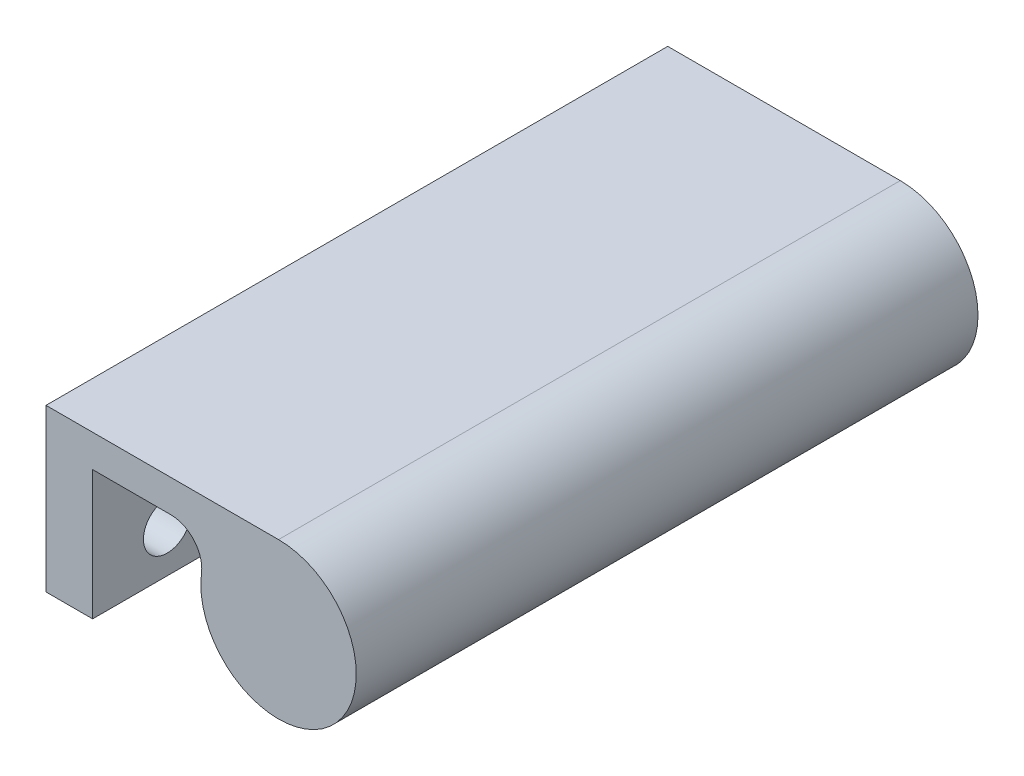
ISO-10303-21;
HEADER;
FILE_DESCRIPTION(('STEP AP214'),'2;1');
FILE_NAME('part.step','',(''),(''),'','','');
FILE_SCHEMA(('AUTOMOTIVE_DESIGN { 1 0 10303 214 1 1 1 1 }'));
ENDSEC;
DATA;
#1=APPLICATION_CONTEXT('core data for automotive mechanical design processes');
#2=APPLICATION_PROTOCOL_DEFINITION('international standard','automotive_design',2000,#1);
#3=PRODUCT_CONTEXT('',#1,'mechanical');
#4=PRODUCT('Part','Part','',(#3));
#5=PRODUCT_RELATED_PRODUCT_CATEGORY('part','',(#4));
#6=PRODUCT_DEFINITION_FORMATION('','',#4);
#7=PRODUCT_DEFINITION_CONTEXT('part definition',#1,'design');
#8=PRODUCT_DEFINITION('design','',#6,#7);
#9=PRODUCT_DEFINITION_SHAPE('','',#8);
#10=(LENGTH_UNIT() NAMED_UNIT(*) SI_UNIT(.MILLI.,.METRE.));
#11=(NAMED_UNIT(*) PLANE_ANGLE_UNIT() SI_UNIT($,.RADIAN.));
#12=(NAMED_UNIT(*) SI_UNIT($,.STERADIAN.) SOLID_ANGLE_UNIT());
#13=UNCERTAINTY_MEASURE_WITH_UNIT(LENGTH_MEASURE(1.E-05),#10,'distance_accuracy_value','');
#14=(GEOMETRIC_REPRESENTATION_CONTEXT(3) GLOBAL_UNCERTAINTY_ASSIGNED_CONTEXT((#13)) GLOBAL_UNIT_ASSIGNED_CONTEXT((#10,
#11,#12)) REPRESENTATION_CONTEXT('',''));
#15=CARTESIAN_POINT('',(0.,0.,0.));
#16=DIRECTION('',(0.,0.,1.));
#17=DIRECTION('',(1.,0.,0.));
#18=AXIS2_PLACEMENT_3D('',#15,#16,#17);
#19=CARTESIAN_POINT('',(4.7625,0.,0.));
#20=DIRECTION('',(0.,0.,-1.));
#21=DIRECTION('',(-1.,0.,0.));
#22=AXIS2_PLACEMENT_3D('',#19,#20,#21);
#23=PLANE('',#22);
#24=DIRECTION('',(0.,-1.,0.));
#25=VECTOR('',#24,1.);
#26=CARTESIAN_POINT('',(0.,0.,0.));
#27=LINE('',#26,#25);
#28=CARTESIAN_POINT('',(0.,16.51,0.));
#29=VERTEX_POINT('',#28);
#30=CARTESIAN_POINT('',(0.,0.,0.));
#31=VERTEX_POINT('',#30);
#32=EDGE_CURVE('E105',#29,#31,#27,.T.);
#33=ORIENTED_EDGE('',*,*,#32,.T.);
#34=DIRECTION('',(-1.,0.,0.));
#35=VECTOR('',#34,1.);
#36=CARTESIAN_POINT('',(4.7625,0.,0.));
#37=LINE('',#36,#35);
#38=CARTESIAN_POINT('',(4.7625,0.,0.));
#39=VERTEX_POINT('',#38);
#40=EDGE_CURVE('E11',#39,#31,#37,.T.);
#41=ORIENTED_EDGE('',*,*,#40,.F.);
#42=DIRECTION('',(0.,-1.,0.));
#43=VECTOR('',#42,1.);
#44=CARTESIAN_POINT('',(4.7625,0.,0.));
#45=LINE('',#44,#43);
#46=CARTESIAN_POINT('',(4.7625,13.208,0.));
#47=VERTEX_POINT('',#46);
#48=EDGE_CURVE('E130',#47,#39,#45,.T.);
#49=ORIENTED_EDGE('',*,*,#48,.F.);
#50=DIRECTION('',(-1.,0.,0.));
#51=VECTOR('',#50,1.);
#52=CARTESIAN_POINT('',(5.7785,13.208,0.));
#53=LINE('',#52,#51);
#54=CARTESIAN_POINT('',(12.7328937913617,13.208,0.));
#55=VERTEX_POINT('',#54);
#56=EDGE_CURVE('E133',#55,#47,#53,.T.);
#57=ORIENTED_EDGE('',*,*,#56,.F.);
#58=CARTESIAN_POINT('',(12.7328937913617,10.033,0.));
#59=DIRECTION('',(0.,0.,-1.));
#60=DIRECTION('',(1.,0.,0.));
#61=AXIS2_PLACEMENT_3D('',#58,#59,#60);
#62=CIRCLE('',#61,3.175);
#63=CARTESIAN_POINT('',(15.8803527081155,9.61571428571428,0.));
#64=VERTEX_POINT('',#63);
#65=EDGE_CURVE('E232',#55,#64,#62,.T.);
#66=ORIENTED_EDGE('',*,*,#65,.T.);
#67=CARTESIAN_POINT('',(23.749,8.5725,0.));
#68=DIRECTION('',(0.,0.,1.));
#69=DIRECTION('',(1.,0.,0.));
#70=AXIS2_PLACEMENT_3D('',#67,#68,#69);
#71=CIRCLE('',#70,7.9375);
#72=CARTESIAN_POINT('',(23.749,16.51,0.));
#73=VERTEX_POINT('',#72);
#74=EDGE_CURVE('E108',#64,#73,#71,.T.);
#75=ORIENTED_EDGE('',*,*,#74,.T.);
#76=DIRECTION('',(-1.,0.,0.));
#77=VECTOR('',#76,1.);
#78=CARTESIAN_POINT('',(4.7625,16.51,0.));
#79=LINE('',#78,#77);
#80=EDGE_CURVE('E91',#73,#29,#79,.T.);
#81=ORIENTED_EDGE('',*,*,#80,.T.);
#82=EDGE_LOOP('',(#33,#41,#49,#57,#66,#75,#81));
#83=FACE_BOUND('',#82,.T.);
#84=ADVANCED_FACE('F45',(#83),#23,.F.);
#85=CARTESIAN_POINT('',(4.7625,0.,0.));
#86=DIRECTION('',(0.,1.,0.));
#87=DIRECTION('',(0.,0.,1.));
#88=AXIS2_PLACEMENT_3D('',#85,#86,#87);
#89=PLANE('',#88);
#90=DIRECTION('',(0.,0.,-1.));
#91=VECTOR('',#90,1.);
#92=CARTESIAN_POINT('',(0.,0.,0.));
#93=LINE('',#92,#91);
#94=CARTESIAN_POINT('',(0.,0.,-63.5));
#95=VERTEX_POINT('',#94);
#96=EDGE_CURVE('E112',#31,#95,#93,.T.);
#97=ORIENTED_EDGE('',*,*,#96,.T.);
#98=DIRECTION('',(-1.,0.,0.));
#99=VECTOR('',#98,1.);
#100=CARTESIAN_POINT('',(4.7625,0.,-63.5));
#101=LINE('',#100,#99);
#102=CARTESIAN_POINT('',(4.7625,0.,-63.5));
#103=VERTEX_POINT('',#102);
#104=EDGE_CURVE('E53',#103,#95,#101,.T.);
#105=ORIENTED_EDGE('',*,*,#104,.F.);
#106=DIRECTION('',(0.,0.,-1.));
#107=VECTOR('',#106,1.);
#108=CARTESIAN_POINT('',(4.7625,0.,0.));
#109=LINE('',#108,#107);
#110=EDGE_CURVE('E66',#39,#103,#109,.T.);
#111=ORIENTED_EDGE('',*,*,#110,.F.);
#112=ORIENTED_EDGE('',*,*,#40,.T.);
#113=EDGE_LOOP('',(#97,#105,#111,#112));
#114=FACE_BOUND('',#113,.T.);
#115=ADVANCED_FACE('F128',(#114),#89,.F.);
#116=CARTESIAN_POINT('',(4.7625,0.,-63.5));
#117=DIRECTION('',(0.,0.,1.));
#118=DIRECTION('',(1.,0.,0.));
#119=AXIS2_PLACEMENT_3D('',#116,#117,#118);
#120=PLANE('',#119);
#121=DIRECTION('',(0.,1.,0.));
#122=VECTOR('',#121,1.);
#123=CARTESIAN_POINT('',(0.,0.,-63.5));
#124=LINE('',#123,#122);
#125=CARTESIAN_POINT('',(0.,16.51,-63.5));
#126=VERTEX_POINT('',#125);
#127=EDGE_CURVE('E99',#95,#126,#124,.T.);
#128=ORIENTED_EDGE('',*,*,#127,.T.);
#129=DIRECTION('',(-1.,0.,0.));
#130=VECTOR('',#129,1.);
#131=CARTESIAN_POINT('',(4.7625,16.51,-63.5));
#132=LINE('',#131,#130);
#133=CARTESIAN_POINT('',(23.749,16.51,-63.5));
#134=VERTEX_POINT('',#133);
#135=EDGE_CURVE('E94',#134,#126,#132,.T.);
#136=ORIENTED_EDGE('',*,*,#135,.F.);
#137=CARTESIAN_POINT('',(23.749,8.5725,-63.5));
#138=DIRECTION('',(0.,0.,1.));
#139=DIRECTION('',(1.,0.,0.));
#140=AXIS2_PLACEMENT_3D('',#137,#138,#139);
#141=CIRCLE('',#140,7.9375);
#142=CARTESIAN_POINT('',(15.8803527081155,9.61571428571428,-63.5));
#143=VERTEX_POINT('',#142);
#144=EDGE_CURVE('E240',#143,#134,#141,.T.);
#145=ORIENTED_EDGE('',*,*,#144,.F.);
#146=CARTESIAN_POINT('',(12.7328937913617,10.033,-63.5));
#147=DIRECTION('',(0.,0.,-1.));
#148=DIRECTION('',(1.,0.,0.));
#149=AXIS2_PLACEMENT_3D('',#146,#147,#148);
#150=CIRCLE('',#149,3.175);
#151=CARTESIAN_POINT('',(12.7328937913617,13.208,-63.5));
#152=VERTEX_POINT('',#151);
#153=EDGE_CURVE('E243',#152,#143,#150,.T.);
#154=ORIENTED_EDGE('',*,*,#153,.F.);
#155=DIRECTION('',(-1.,0.,0.));
#156=VECTOR('',#155,1.);
#157=CARTESIAN_POINT('',(5.7785,13.208,-63.5));
#158=LINE('',#157,#156);
#159=CARTESIAN_POINT('',(4.7625,13.208,-63.5));
#160=VERTEX_POINT('',#159);
#161=EDGE_CURVE('E144',#152,#160,#158,.T.);
#162=ORIENTED_EDGE('',*,*,#161,.T.);
#163=DIRECTION('',(0.,1.,0.));
#164=VECTOR('',#163,1.);
#165=CARTESIAN_POINT('',(4.7625,0.,-63.5));
#166=LINE('',#165,#164);
#167=EDGE_CURVE('E109',#103,#160,#166,.T.);
#168=ORIENTED_EDGE('',*,*,#167,.F.);
#169=ORIENTED_EDGE('',*,*,#104,.T.);
#170=EDGE_LOOP('',(#128,#136,#145,#154,#162,#168,#169));
#171=FACE_BOUND('',#170,.T.);
#172=ADVANCED_FACE('F125',(#171),#120,.F.);
#173=CARTESIAN_POINT('',(4.7625,4.445,-7.62));
#174=DIRECTION('',(-1.,0.,0.));
#175=DIRECTION('',(0.,0.,1.));
#176=AXIS2_PLACEMENT_3D('',#173,#174,#175);
#177=CYLINDRICAL_SURFACE('',#176,2.4328565762324);
#178=CARTESIAN_POINT('',(4.7625,4.445,-7.62));
#179=DIRECTION('',(1.,0.,0.));
#180=DIRECTION('',(0.,0.,-1.));
#181=AXIS2_PLACEMENT_3D('',#178,#179,#180);
#182=CIRCLE('',#181,2.4328565762324);
#183=CARTESIAN_POINT('',(4.7625,4.445,-10.0528565762324));
#184=VERTEX_POINT('',#183);
#185=EDGE_CURVE('E135',#184,#184,#182,.T.);
#186=ORIENTED_EDGE('',*,*,#185,.T.);
#187=EDGE_LOOP('',(#186));
#188=FACE_BOUND('',#187,.T.);
#189=CARTESIAN_POINT('',(0.,4.445,-7.62));
#190=DIRECTION('',(1.,0.,0.));
#191=DIRECTION('',(0.,0.,-1.));
#192=AXIS2_PLACEMENT_3D('',#189,#190,#191);
#193=CIRCLE('',#192,2.4328565762324);
#194=CARTESIAN_POINT('',(0.,4.445,-10.0528565762324));
#195=VERTEX_POINT('',#194);
#196=EDGE_CURVE('E113',#195,#195,#193,.T.);
#197=ORIENTED_EDGE('',*,*,#196,.F.);
#198=EDGE_LOOP('',(#197));
#199=FACE_BOUND('',#198,.T.);
#200=ADVANCED_FACE('F191',(#188,#199),#177,.F.);
#201=CARTESIAN_POINT('',(4.7625,4.445,-15.61846));
#202=DIRECTION('',(-1.,0.,0.));
#203=DIRECTION('',(0.,0.,1.));
#204=AXIS2_PLACEMENT_3D('',#201,#202,#203);
#205=CYLINDRICAL_SURFACE('',#204,2.4328565762324);
#206=CARTESIAN_POINT('',(4.7625,4.445,-15.61846));
#207=DIRECTION('',(1.,0.,0.));
#208=DIRECTION('',(0.,0.,-1.));
#209=AXIS2_PLACEMENT_3D('',#206,#207,#208);
#210=CIRCLE('',#209,2.4328565762324);
#211=CARTESIAN_POINT('',(4.7625,4.445,-18.0513165762324));
#212=VERTEX_POINT('',#211);
#213=EDGE_CURVE('E166',#212,#212,#210,.T.);
#214=ORIENTED_EDGE('',*,*,#213,.T.);
#215=EDGE_LOOP('',(#214));
#216=FACE_BOUND('',#215,.T.);
#217=CARTESIAN_POINT('',(0.,4.445,-15.61846));
#218=DIRECTION('',(1.,0.,0.));
#219=DIRECTION('',(0.,0.,-1.));
#220=AXIS2_PLACEMENT_3D('',#217,#218,#219);
#221=CIRCLE('',#220,2.4328565762324);
#222=CARTESIAN_POINT('',(0.,4.445,-18.0513165762324));
#223=VERTEX_POINT('',#222);
#224=EDGE_CURVE('E117',#223,#223,#221,.T.);
#225=ORIENTED_EDGE('',*,*,#224,.F.);
#226=EDGE_LOOP('',(#225));
#227=FACE_BOUND('',#226,.T.);
#228=ADVANCED_FACE('F188',(#216,#227),#205,.F.);
#229=CARTESIAN_POINT('',(4.7625,4.44500000000001,-23.61692));
#230=DIRECTION('',(-1.,0.,0.));
#231=DIRECTION('',(0.,0.,1.));
#232=AXIS2_PLACEMENT_3D('',#229,#230,#231);
#233=CYLINDRICAL_SURFACE('',#232,2.4328565762324);
#234=CARTESIAN_POINT('',(4.7625,4.44500000000001,-23.61692));
#235=DIRECTION('',(1.,0.,0.));
#236=DIRECTION('',(0.,0.,-1.));
#237=AXIS2_PLACEMENT_3D('',#234,#235,#236);
#238=CIRCLE('',#237,2.4328565762324);
#239=CARTESIAN_POINT('',(4.7625,4.44500000000001,-26.0497765762324));
#240=VERTEX_POINT('',#239);
#241=EDGE_CURVE('E163',#240,#240,#238,.T.);
#242=ORIENTED_EDGE('',*,*,#241,.T.);
#243=EDGE_LOOP('',(#242));
#244=FACE_BOUND('',#243,.T.);
#245=CARTESIAN_POINT('',(0.,4.44500000000001,-23.61692));
#246=DIRECTION('',(1.,0.,0.));
#247=DIRECTION('',(0.,0.,-1.));
#248=AXIS2_PLACEMENT_3D('',#245,#246,#247);
#249=CIRCLE('',#248,2.4328565762324);
#250=CARTESIAN_POINT('',(0.,4.44500000000001,-26.0497765762324));
#251=VERTEX_POINT('',#250);
#252=EDGE_CURVE('E181',#251,#251,#249,.T.);
#253=ORIENTED_EDGE('',*,*,#252,.F.);
#254=EDGE_LOOP('',(#253));
#255=FACE_BOUND('',#254,.T.);
#256=ADVANCED_FACE('F190',(#244,#255),#233,.F.);
#257=CARTESIAN_POINT('',(4.7625,4.44500000000001,-31.61538));
#258=DIRECTION('',(-1.,0.,0.));
#259=DIRECTION('',(0.,0.,1.));
#260=AXIS2_PLACEMENT_3D('',#257,#258,#259);
#261=CYLINDRICAL_SURFACE('',#260,2.4328565762324);
#262=CARTESIAN_POINT('',(4.7625,4.44500000000001,-31.61538));
#263=DIRECTION('',(1.,0.,0.));
#264=DIRECTION('',(0.,0.,-1.));
#265=AXIS2_PLACEMENT_3D('',#262,#263,#264);
#266=CIRCLE('',#265,2.4328565762324);
#267=CARTESIAN_POINT('',(4.7625,4.44500000000001,-34.0482365762324));
#268=VERTEX_POINT('',#267);
#269=EDGE_CURVE('E160',#268,#268,#266,.T.);
#270=ORIENTED_EDGE('',*,*,#269,.T.);
#271=EDGE_LOOP('',(#270));
#272=FACE_BOUND('',#271,.T.);
#273=CARTESIAN_POINT('',(0.,4.44500000000001,-31.61538));
#274=DIRECTION('',(1.,0.,0.));
#275=DIRECTION('',(0.,0.,-1.));
#276=AXIS2_PLACEMENT_3D('',#273,#274,#275);
#277=CIRCLE('',#276,2.4328565762324);
#278=CARTESIAN_POINT('',(0.,4.44500000000001,-34.0482365762324));
#279=VERTEX_POINT('',#278);
#280=EDGE_CURVE('E178',#279,#279,#277,.T.);
#281=ORIENTED_EDGE('',*,*,#280,.F.);
#282=EDGE_LOOP('',(#281));
#283=FACE_BOUND('',#282,.T.);
#284=ADVANCED_FACE('F198',(#272,#283),#261,.F.);
#285=CARTESIAN_POINT('',(4.7625,4.44500000000001,-39.61384));
#286=DIRECTION('',(-1.,0.,0.));
#287=DIRECTION('',(0.,0.,1.));
#288=AXIS2_PLACEMENT_3D('',#285,#286,#287);
#289=CYLINDRICAL_SURFACE('',#288,2.4328565762324);
#290=CARTESIAN_POINT('',(4.7625,4.44500000000001,-39.61384));
#291=DIRECTION('',(1.,0.,0.));
#292=DIRECTION('',(0.,0.,-1.));
#293=AXIS2_PLACEMENT_3D('',#290,#291,#292);
#294=CIRCLE('',#293,2.4328565762324);
#295=CARTESIAN_POINT('',(4.7625,4.44500000000001,-42.0466965762324));
#296=VERTEX_POINT('',#295);
#297=EDGE_CURVE('E157',#296,#296,#294,.T.);
#298=ORIENTED_EDGE('',*,*,#297,.T.);
#299=EDGE_LOOP('',(#298));
#300=FACE_BOUND('',#299,.T.);
#301=CARTESIAN_POINT('',(0.,4.44500000000001,-39.61384));
#302=DIRECTION('',(1.,0.,0.));
#303=DIRECTION('',(0.,0.,-1.));
#304=AXIS2_PLACEMENT_3D('',#301,#302,#303);
#305=CIRCLE('',#304,2.4328565762324);
#306=CARTESIAN_POINT('',(0.,4.44500000000001,-42.0466965762324));
#307=VERTEX_POINT('',#306);
#308=EDGE_CURVE('E175',#307,#307,#305,.T.);
#309=ORIENTED_EDGE('',*,*,#308,.F.);
#310=EDGE_LOOP('',(#309));
#311=FACE_BOUND('',#310,.T.);
#312=ADVANCED_FACE('F281',(#300,#311),#289,.F.);
#313=CARTESIAN_POINT('',(4.7625,4.44500000000001,-47.6123));
#314=DIRECTION('',(-1.,0.,0.));
#315=DIRECTION('',(0.,0.,1.));
#316=AXIS2_PLACEMENT_3D('',#313,#314,#315);
#317=CYLINDRICAL_SURFACE('',#316,2.4328565762324);
#318=CARTESIAN_POINT('',(4.7625,4.44500000000001,-47.6123));
#319=DIRECTION('',(1.,0.,0.));
#320=DIRECTION('',(0.,0.,-1.));
#321=AXIS2_PLACEMENT_3D('',#318,#319,#320);
#322=CIRCLE('',#321,2.4328565762324);
#323=CARTESIAN_POINT('',(4.7625,4.44500000000001,-50.0451565762324));
#324=VERTEX_POINT('',#323);
#325=EDGE_CURVE('E154',#324,#324,#322,.T.);
#326=ORIENTED_EDGE('',*,*,#325,.T.);
#327=EDGE_LOOP('',(#326));
#328=FACE_BOUND('',#327,.T.);
#329=CARTESIAN_POINT('',(0.,4.44500000000001,-47.6123));
#330=DIRECTION('',(1.,0.,0.));
#331=DIRECTION('',(0.,0.,-1.));
#332=AXIS2_PLACEMENT_3D('',#329,#330,#331);
#333=CIRCLE('',#332,2.4328565762324);
#334=CARTESIAN_POINT('',(0.,4.44500000000001,-50.0451565762324));
#335=VERTEX_POINT('',#334);
#336=EDGE_CURVE('E147',#335,#335,#333,.T.);
#337=ORIENTED_EDGE('',*,*,#336,.F.);
#338=EDGE_LOOP('',(#337));
#339=FACE_BOUND('',#338,.T.);
#340=ADVANCED_FACE('F288',(#328,#339),#317,.F.);
#341=CARTESIAN_POINT('',(4.7625,4.44500000000001,-55.61076));
#342=DIRECTION('',(-1.,0.,0.));
#343=DIRECTION('',(0.,0.,1.));
#344=AXIS2_PLACEMENT_3D('',#341,#342,#343);
#345=CYLINDRICAL_SURFACE('',#344,2.4328565762324);
#346=CARTESIAN_POINT('',(4.7625,4.44500000000001,-55.61076));
#347=DIRECTION('',(1.,0.,0.));
#348=DIRECTION('',(0.,0.,-1.));
#349=AXIS2_PLACEMENT_3D('',#346,#347,#348);
#350=CIRCLE('',#349,2.4328565762324);
#351=CARTESIAN_POINT('',(4.7625,4.44500000000001,-58.0436165762324));
#352=VERTEX_POINT('',#351);
#353=EDGE_CURVE('E98',#352,#352,#350,.T.);
#354=ORIENTED_EDGE('',*,*,#353,.T.);
#355=EDGE_LOOP('',(#354));
#356=FACE_BOUND('',#355,.T.);
#357=CARTESIAN_POINT('',(0.,4.44500000000001,-55.61076));
#358=DIRECTION('',(1.,0.,0.));
#359=DIRECTION('',(0.,0.,-1.));
#360=AXIS2_PLACEMENT_3D('',#357,#358,#359);
#361=CIRCLE('',#360,2.4328565762324);
#362=CARTESIAN_POINT('',(0.,4.44500000000001,-58.0436165762324));
#363=VERTEX_POINT('',#362);
#364=EDGE_CURVE('E143',#363,#363,#361,.T.);
#365=ORIENTED_EDGE('',*,*,#364,.F.);
#366=EDGE_LOOP('',(#365));
#367=FACE_BOUND('',#366,.T.);
#368=ADVANCED_FACE('F47',(#356,#367),#345,.F.);
#369=CARTESIAN_POINT('',(4.7625,16.51,0.));
#370=DIRECTION('',(0.,-1.,0.));
#371=DIRECTION('',(0.,0.,-1.));
#372=AXIS2_PLACEMENT_3D('',#369,#370,#371);
#373=PLANE('',#372);
#374=DIRECTION('',(0.,0.,1.));
#375=VECTOR('',#374,1.);
#376=CARTESIAN_POINT('',(0.,16.51,0.));
#377=LINE('',#376,#375);
#378=EDGE_CURVE('E86',#126,#29,#377,.T.);
#379=ORIENTED_EDGE('',*,*,#378,.T.);
#380=ORIENTED_EDGE('',*,*,#80,.F.);
#381=DIRECTION('',(0.,0.,1.));
#382=VECTOR('',#381,1.);
#383=CARTESIAN_POINT('',(23.749,16.51,-63.5));
#384=LINE('',#383,#382);
#385=EDGE_CURVE('E250',#134,#73,#384,.T.);
#386=ORIENTED_EDGE('',*,*,#385,.F.);
#387=ORIENTED_EDGE('',*,*,#135,.T.);
#388=EDGE_LOOP('',(#379,#380,#386,#387));
#389=FACE_BOUND('',#388,.T.);
#390=ADVANCED_FACE('F88',(#389),#373,.F.);
#391=CARTESIAN_POINT('',(4.7625,0.,0.));
#392=DIRECTION('',(1.,0.,0.));
#393=DIRECTION('',(0.,0.,-1.));
#394=AXIS2_PLACEMENT_3D('',#391,#392,#393);
#395=PLANE('',#394);
#396=DIRECTION('',(0.,0.,-1.));
#397=VECTOR('',#396,1.);
#398=CARTESIAN_POINT('',(4.7625,13.208,0.));
#399=LINE('',#398,#397);
#400=EDGE_CURVE('E60',#47,#160,#399,.T.);
#401=ORIENTED_EDGE('',*,*,#400,.F.);
#402=ORIENTED_EDGE('',*,*,#48,.T.);
#403=ORIENTED_EDGE('',*,*,#110,.T.);
#404=ORIENTED_EDGE('',*,*,#167,.T.);
#405=EDGE_LOOP('',(#401,#402,#403,#404));
#406=FACE_BOUND('',#405,.T.);
#407=ORIENTED_EDGE('',*,*,#353,.F.);
#408=EDGE_LOOP('',(#407));
#409=FACE_BOUND('',#408,.T.);
#410=ORIENTED_EDGE('',*,*,#325,.F.);
#411=EDGE_LOOP('',(#410));
#412=FACE_BOUND('',#411,.T.);
#413=ORIENTED_EDGE('',*,*,#297,.F.);
#414=EDGE_LOOP('',(#413));
#415=FACE_BOUND('',#414,.T.);
#416=ORIENTED_EDGE('',*,*,#269,.F.);
#417=EDGE_LOOP('',(#416));
#418=FACE_BOUND('',#417,.T.);
#419=ORIENTED_EDGE('',*,*,#241,.F.);
#420=EDGE_LOOP('',(#419));
#421=FACE_BOUND('',#420,.T.);
#422=ORIENTED_EDGE('',*,*,#213,.F.);
#423=EDGE_LOOP('',(#422));
#424=FACE_BOUND('',#423,.T.);
#425=ORIENTED_EDGE('',*,*,#185,.F.);
#426=EDGE_LOOP('',(#425));
#427=FACE_BOUND('',#426,.T.);
#428=ADVANCED_FACE('F215',(#406,#409,#412,#415,#418,#421,#424,#427),#395,.T.);
#429=CARTESIAN_POINT('',(0.,0.,0.));
#430=DIRECTION('',(1.,0.,0.));
#431=DIRECTION('',(0.,0.,-1.));
#432=AXIS2_PLACEMENT_3D('',#429,#430,#431);
#433=PLANE('',#432);
#434=ORIENTED_EDGE('',*,*,#364,.T.);
#435=EDGE_LOOP('',(#434));
#436=FACE_BOUND('',#435,.T.);
#437=ORIENTED_EDGE('',*,*,#336,.T.);
#438=EDGE_LOOP('',(#437));
#439=FACE_BOUND('',#438,.T.);
#440=ORIENTED_EDGE('',*,*,#308,.T.);
#441=EDGE_LOOP('',(#440));
#442=FACE_BOUND('',#441,.T.);
#443=ORIENTED_EDGE('',*,*,#280,.T.);
#444=EDGE_LOOP('',(#443));
#445=FACE_BOUND('',#444,.T.);
#446=ORIENTED_EDGE('',*,*,#252,.T.);
#447=EDGE_LOOP('',(#446));
#448=FACE_BOUND('',#447,.T.);
#449=ORIENTED_EDGE('',*,*,#224,.T.);
#450=EDGE_LOOP('',(#449));
#451=FACE_BOUND('',#450,.T.);
#452=ORIENTED_EDGE('',*,*,#196,.T.);
#453=EDGE_LOOP('',(#452));
#454=FACE_BOUND('',#453,.T.);
#455=ORIENTED_EDGE('',*,*,#32,.F.);
#456=ORIENTED_EDGE('',*,*,#378,.F.);
#457=ORIENTED_EDGE('',*,*,#127,.F.);
#458=ORIENTED_EDGE('',*,*,#96,.F.);
#459=EDGE_LOOP('',(#455,#456,#457,#458));
#460=FACE_BOUND('',#459,.T.);
#461=ADVANCED_FACE('F111',(#436,#439,#442,#445,#448,#451,#454,#460),#433,.F.);
#462=CARTESIAN_POINT('',(5.7785,13.208,0.));
#463=DIRECTION('',(0.,1.,0.));
#464=DIRECTION('',(0.,0.,1.));
#465=AXIS2_PLACEMENT_3D('',#462,#463,#464);
#466=PLANE('',#465);
#467=ORIENTED_EDGE('',*,*,#400,.T.);
#468=ORIENTED_EDGE('',*,*,#161,.F.);
#469=DIRECTION('',(0.,0.,1.));
#470=VECTOR('',#469,1.);
#471=CARTESIAN_POINT('',(12.7328937913617,13.208,-63.5));
#472=LINE('',#471,#470);
#473=EDGE_CURVE('E141',#152,#55,#472,.T.);
#474=ORIENTED_EDGE('',*,*,#473,.T.);
#475=ORIENTED_EDGE('',*,*,#56,.T.);
#476=EDGE_LOOP('',(#467,#468,#474,#475));
#477=FACE_BOUND('',#476,.T.);
#478=ADVANCED_FACE('F138',(#477),#466,.F.);
#479=CARTESIAN_POINT('',(23.749,8.5725,-63.5));
#480=DIRECTION('',(0.,0.,1.));
#481=DIRECTION('',(1.,0.,0.));
#482=AXIS2_PLACEMENT_3D('',#479,#480,#481);
#483=CYLINDRICAL_SURFACE('',#482,7.9375);
#484=ORIENTED_EDGE('',*,*,#74,.F.);
#485=DIRECTION('',(0.,0.,1.));
#486=VECTOR('',#485,1.);
#487=CARTESIAN_POINT('',(15.8803527081155,9.61571428571428,-63.5));
#488=LINE('',#487,#486);
#489=EDGE_CURVE('E238',#143,#64,#488,.T.);
#490=ORIENTED_EDGE('',*,*,#489,.F.);
#491=ORIENTED_EDGE('',*,*,#144,.T.);
#492=ORIENTED_EDGE('',*,*,#385,.T.);
#493=EDGE_LOOP('',(#484,#490,#491,#492));
#494=FACE_BOUND('',#493,.T.);
#495=ADVANCED_FACE('F222',(#494),#483,.T.);
#496=CARTESIAN_POINT('',(12.7328937913617,10.033,-63.5));
#497=DIRECTION('',(0.,0.,1.));
#498=DIRECTION('',(1.,0.,0.));
#499=AXIS2_PLACEMENT_3D('',#496,#497,#498);
#500=CYLINDRICAL_SURFACE('',#499,3.175);
#501=ORIENTED_EDGE('',*,*,#65,.F.);
#502=ORIENTED_EDGE('',*,*,#473,.F.);
#503=ORIENTED_EDGE('',*,*,#153,.T.);
#504=ORIENTED_EDGE('',*,*,#489,.T.);
#505=EDGE_LOOP('',(#501,#502,#503,#504));
#506=FACE_BOUND('',#505,.T.);
#507=ADVANCED_FACE('F225',(#506),#500,.F.);
#508=CLOSED_SHELL('',(#84,#115,#172,#200,#228,#256,#284,#312,#340,#368,#390,#428,#461,#478,#495,#507));
#509=MANIFOLD_SOLID_BREP('B2',#508);
#510=ADVANCED_BREP_SHAPE_REPRESENTATION('',(#18,#509),#14);
#511=SHAPE_DEFINITION_REPRESENTATION(#9,#510);
ENDSEC;
END-ISO-10303-21;
